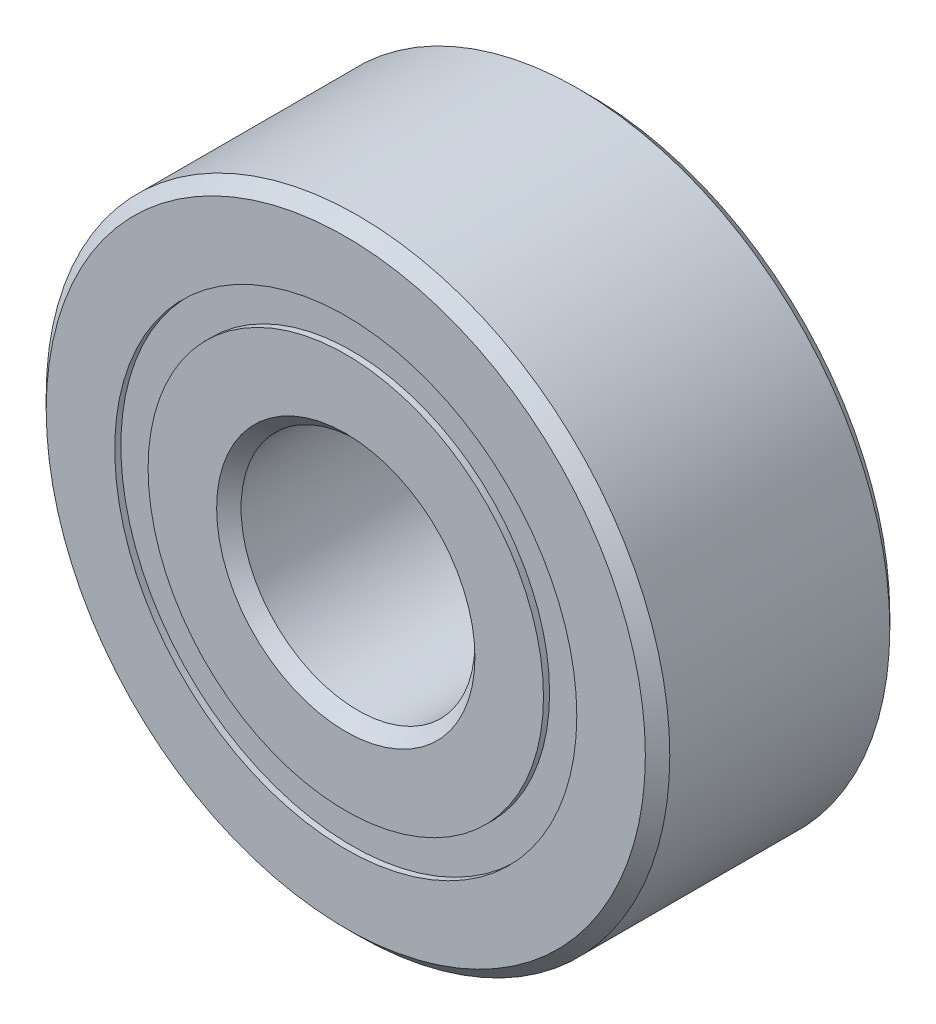
ISO-10303-21;
HEADER;
FILE_DESCRIPTION(('STEP AP214'),'2;1');
FILE_NAME('part.step','',(''),(''),'','','');
FILE_SCHEMA(('AUTOMOTIVE_DESIGN { 1 0 10303 214 1 1 1 1 }'));
ENDSEC;
DATA;
#1=APPLICATION_CONTEXT('core data for automotive mechanical design processes');
#2=APPLICATION_PROTOCOL_DEFINITION('international standard','automotive_design',2000,#1);
#3=PRODUCT_CONTEXT('',#1,'mechanical');
#4=PRODUCT('Part','Part','',(#3));
#5=PRODUCT_RELATED_PRODUCT_CATEGORY('part','',(#4));
#6=PRODUCT_DEFINITION_FORMATION('','',#4);
#7=PRODUCT_DEFINITION_CONTEXT('part definition',#1,'design');
#8=PRODUCT_DEFINITION('design','',#6,#7);
#9=PRODUCT_DEFINITION_SHAPE('','',#8);
#10=(LENGTH_UNIT() NAMED_UNIT(*) SI_UNIT(.MILLI.,.METRE.));
#11=(NAMED_UNIT(*) PLANE_ANGLE_UNIT() SI_UNIT($,.RADIAN.));
#12=(NAMED_UNIT(*) SI_UNIT($,.STERADIAN.) SOLID_ANGLE_UNIT());
#13=UNCERTAINTY_MEASURE_WITH_UNIT(LENGTH_MEASURE(1.E-05),#10,'distance_accuracy_value','');
#14=(GEOMETRIC_REPRESENTATION_CONTEXT(3) GLOBAL_UNCERTAINTY_ASSIGNED_CONTEXT((#13)) GLOBAL_UNIT_ASSIGNED_CONTEXT((#10,
#11,#12)) REPRESENTATION_CONTEXT('',''));
#15=CARTESIAN_POINT('',(0.,0.,0.));
#16=DIRECTION('',(0.,0.,1.));
#17=DIRECTION('',(1.,0.,0.));
#18=AXIS2_PLACEMENT_3D('',#15,#16,#17);
#19=CARTESIAN_POINT('',(0.,4.70503598901099,-2.36474000000001));
#20=DIRECTION('',(0.,0.,1.));
#21=DIRECTION('',(1.,0.,0.));
#22=AXIS2_PLACEMENT_3D('',#19,#20,#21);
#23=PLANE('',#22);
#24=CARTESIAN_POINT('',(0.,0.,-2.36474000000001));
#25=DIRECTION('',(0.,0.,1.));
#26=DIRECTION('',(1.,0.,0.));
#27=AXIS2_PLACEMENT_3D('',#24,#25,#26);
#28=CIRCLE('',#27,4.70503598901099);
#29=CARTESIAN_POINT('',(4.70503598901099,0.,-2.36474000000001));
#30=VERTEX_POINT('',#29);
#31=EDGE_CURVE('E60',#30,#30,#28,.T.);
#32=ORIENTED_EDGE('',*,*,#31,.F.);
#33=EDGE_LOOP('',(#32));
#34=FACE_BOUND('',#33,.T.);
#35=CARTESIAN_POINT('',(0.,0.,-2.36474000000001));
#36=DIRECTION('',(0.,0.,1.));
#37=DIRECTION('',(1.,0.,0.));
#38=AXIS2_PLACEMENT_3D('',#35,#36,#37);
#39=CIRCLE('',#38,4.02621401098901);
#40=CARTESIAN_POINT('',(4.02621401098901,0.,-2.36474000000001));
#41=VERTEX_POINT('',#40);
#42=EDGE_CURVE('E11',#41,#41,#39,.T.);
#43=ORIENTED_EDGE('',*,*,#42,.T.);
#44=EDGE_LOOP('',(#43));
#45=FACE_BOUND('',#44,.T.);
#46=ADVANCED_FACE('F46',(#34,#45),#23,.F.);
#47=CARTESIAN_POINT('',(0.,0.,2.4892));
#48=DIRECTION('',(0.,0.,1.));
#49=DIRECTION('',(1.,0.,0.));
#50=AXIS2_PLACEMENT_3D('',#47,#48,#49);
#51=CYLINDRICAL_SURFACE('',#50,4.02621401098901);
#52=ORIENTED_EDGE('',*,*,#42,.F.);
#53=EDGE_LOOP('',(#52));
#54=FACE_BOUND('',#53,.T.);
#55=CARTESIAN_POINT('',(0.,0.,-1.15720529467736));
#56=DIRECTION('',(0.,0.,1.));
#57=DIRECTION('',(1.,0.,0.));
#58=AXIS2_PLACEMENT_3D('',#55,#56,#57);
#59=CIRCLE('',#58,4.02621401098901);
#60=CARTESIAN_POINT('',(4.02621401098901,0.,-1.15720529467736));
#61=VERTEX_POINT('',#60);
#62=EDGE_CURVE('E52',#61,#61,#59,.T.);
#63=ORIENTED_EDGE('',*,*,#62,.T.);
#64=EDGE_LOOP('',(#63));
#65=FACE_BOUND('',#64,.T.);
#66=ADVANCED_FACE('F69',(#54,#65),#51,.F.);
#67=CARTESIAN_POINT('',(0.,4.70503598901099,-1.15720529467736));
#68=DIRECTION('',(0.,0.,-1.));
#69=DIRECTION('',(-1.,0.,0.));
#70=AXIS2_PLACEMENT_3D('',#67,#68,#69);
#71=PLANE('',#70);
#72=ORIENTED_EDGE('',*,*,#62,.F.);
#73=EDGE_LOOP('',(#72));
#74=FACE_BOUND('',#73,.T.);
#75=CARTESIAN_POINT('',(0.,0.,-1.15720529467736));
#76=DIRECTION('',(0.,0.,1.));
#77=DIRECTION('',(1.,0.,0.));
#78=AXIS2_PLACEMENT_3D('',#75,#76,#77);
#79=CIRCLE('',#78,4.70503598901099);
#80=CARTESIAN_POINT('',(4.70503598901099,0.,-1.15720529467736));
#81=VERTEX_POINT('',#80);
#82=EDGE_CURVE('E56',#81,#81,#79,.T.);
#83=ORIENTED_EDGE('',*,*,#82,.T.);
#84=EDGE_LOOP('',(#83));
#85=FACE_BOUND('',#84,.T.);
#86=ADVANCED_FACE('F73',(#74,#85),#71,.F.);
#87=CARTESIAN_POINT('',(0.,0.,2.4892));
#88=DIRECTION('',(0.,0.,1.));
#89=DIRECTION('',(1.,0.,0.));
#90=AXIS2_PLACEMENT_3D('',#87,#88,#89);
#91=CYLINDRICAL_SURFACE('',#90,4.70503598901099);
#92=ORIENTED_EDGE('',*,*,#82,.F.);
#93=EDGE_LOOP('',(#92));
#94=FACE_BOUND('',#93,.T.);
#95=ORIENTED_EDGE('',*,*,#31,.T.);
#96=EDGE_LOOP('',(#95));
#97=FACE_BOUND('',#96,.T.);
#98=ADVANCED_FACE('F66',(#94,#97),#91,.T.);
#99=CLOSED_SHELL('',(#46,#66,#86,#98));
#100=MANIFOLD_SOLID_BREP('B2',#99);
#101=CARTESIAN_POINT('',(0.,4.70503598901099,2.36474));
#102=DIRECTION('',(0.,0.,-1.));
#103=DIRECTION('',(-1.,0.,0.));
#104=AXIS2_PLACEMENT_3D('',#101,#102,#103);
#105=PLANE('',#104);
#106=CARTESIAN_POINT('',(0.,0.,2.36474));
#107=DIRECTION('',(0.,0.,1.));
#108=DIRECTION('',(1.,0.,0.));
#109=AXIS2_PLACEMENT_3D('',#106,#107,#108);
#110=CIRCLE('',#109,4.02621401098901);
#111=CARTESIAN_POINT('',(4.02621401098901,0.,2.36474));
#112=VERTEX_POINT('',#111);
#113=EDGE_CURVE('E45',#112,#112,#110,.T.);
#114=ORIENTED_EDGE('',*,*,#113,.F.);
#115=EDGE_LOOP('',(#114));
#116=FACE_BOUND('',#115,.T.);
#117=CARTESIAN_POINT('',(0.,0.,2.36474));
#118=DIRECTION('',(0.,0.,1.));
#119=DIRECTION('',(1.,0.,0.));
#120=AXIS2_PLACEMENT_3D('',#117,#118,#119);
#121=CIRCLE('',#120,4.70503598901099);
#122=CARTESIAN_POINT('',(4.70503598901099,0.,2.36474));
#123=VERTEX_POINT('',#122);
#124=EDGE_CURVE('E128',#123,#123,#121,.T.);
#125=ORIENTED_EDGE('',*,*,#124,.T.);
#126=EDGE_LOOP('',(#125));
#127=FACE_BOUND('',#126,.T.);
#128=ADVANCED_FACE('F114',(#116,#127),#105,.F.);
#129=CARTESIAN_POINT('',(0.,0.,2.4892));
#130=DIRECTION('',(0.,0.,1.));
#131=DIRECTION('',(1.,0.,0.));
#132=AXIS2_PLACEMENT_3D('',#129,#130,#131);
#133=CYLINDRICAL_SURFACE('',#132,4.02621401098901);
#134=CARTESIAN_POINT('',(0.,0.,1.15720529467736));
#135=DIRECTION('',(0.,0.,1.));
#136=DIRECTION('',(1.,0.,0.));
#137=AXIS2_PLACEMENT_3D('',#134,#135,#136);
#138=CIRCLE('',#137,4.02621401098901);
#139=CARTESIAN_POINT('',(4.02621401098901,0.,1.15720529467736));
#140=VERTEX_POINT('',#139);
#141=EDGE_CURVE('E120',#140,#140,#138,.T.);
#142=ORIENTED_EDGE('',*,*,#141,.F.);
#143=EDGE_LOOP('',(#142));
#144=FACE_BOUND('',#143,.T.);
#145=ORIENTED_EDGE('',*,*,#113,.T.);
#146=EDGE_LOOP('',(#145));
#147=FACE_BOUND('',#146,.T.);
#148=ADVANCED_FACE('F143',(#144,#147),#133,.F.);
#149=CARTESIAN_POINT('',(0.,4.70503598901099,1.15720529467736));
#150=DIRECTION('',(0.,0.,1.));
#151=DIRECTION('',(1.,0.,0.));
#152=AXIS2_PLACEMENT_3D('',#149,#150,#151);
#153=PLANE('',#152);
#154=CARTESIAN_POINT('',(0.,0.,1.15720529467736));
#155=DIRECTION('',(0.,0.,1.));
#156=DIRECTION('',(1.,0.,0.));
#157=AXIS2_PLACEMENT_3D('',#154,#155,#156);
#158=CIRCLE('',#157,4.70503598901099);
#159=CARTESIAN_POINT('',(4.70503598901099,0.,1.15720529467736));
#160=VERTEX_POINT('',#159);
#161=EDGE_CURVE('E124',#160,#160,#158,.T.);
#162=ORIENTED_EDGE('',*,*,#161,.F.);
#163=EDGE_LOOP('',(#162));
#164=FACE_BOUND('',#163,.T.);
#165=ORIENTED_EDGE('',*,*,#141,.T.);
#166=EDGE_LOOP('',(#165));
#167=FACE_BOUND('',#166,.T.);
#168=ADVANCED_FACE('F138',(#164,#167),#153,.F.);
#169=CARTESIAN_POINT('',(0.,0.,2.4892));
#170=DIRECTION('',(0.,0.,1.));
#171=DIRECTION('',(1.,0.,0.));
#172=AXIS2_PLACEMENT_3D('',#169,#170,#171);
#173=CYLINDRICAL_SURFACE('',#172,4.70503598901099);
#174=ORIENTED_EDGE('',*,*,#124,.F.);
#175=EDGE_LOOP('',(#174));
#176=FACE_BOUND('',#175,.T.);
#177=ORIENTED_EDGE('',*,*,#161,.T.);
#178=EDGE_LOOP('',(#177));
#179=FACE_BOUND('',#178,.T.);
#180=ADVANCED_FACE('F135',(#176,#179),#173,.T.);
#181=CLOSED_SHELL('',(#128,#148,#168,#180));
#182=MANIFOLD_SOLID_BREP('B6',#181);
#183=CARTESIAN_POINT('',(-3.08696304161748,3.08696304161756,0.));
#184=DIRECTION('',(0.,0.,1.));
#185=DIRECTION('',(-0.707106781186539,0.707106781186556,0.));
#186=AXIS2_PLACEMENT_3D('',#183,#184,#185);
#187=SPHERICAL_SURFACE('',#186,1.15720529467736);
#188=CARTESIAN_POINT('',(-3.08696304161748,3.08696304161756,1.15720529467736));
#189=VERTEX_POINT('',#188);
#190=VERTEX_LOOP('',#189);
#191=FACE_BOUND('',#190,.T.);
#192=ADVANCED_FACE('F182',(#191),#187,.T.);
#193=CLOSED_SHELL('',(#192));
#194=MANIFOLD_SOLID_BREP('B40',#193);
#195=CARTESIAN_POINT('',(-4.365625,0.,0.));
#196=DIRECTION('',(0.,0.,1.));
#197=DIRECTION('',(-1.,0.,0.));
#198=AXIS2_PLACEMENT_3D('',#195,#196,#197);
#199=SPHERICAL_SURFACE('',#198,1.15720529467736);
#200=CARTESIAN_POINT('',(-4.365625,0.,1.15720529467736));
#201=VERTEX_POINT('',#200);
#202=VERTEX_LOOP('',#201);
#203=FACE_BOUND('',#202,.T.);
#204=ADVANCED_FACE('F203',(#203),#199,.T.);
#205=CLOSED_SHELL('',(#204));
#206=MANIFOLD_SOLID_BREP('B110',#205);
#207=CARTESIAN_POINT('',(-3.08696304161755,-3.0869630416175,0.));
#208=DIRECTION('',(0.,0.,1.));
#209=DIRECTION('',(-0.707106781186554,-0.707106781186541,0.));
#210=AXIS2_PLACEMENT_3D('',#207,#208,#209);
#211=SPHERICAL_SURFACE('',#210,1.15720529467736);
#212=CARTESIAN_POINT('',(-3.08696304161755,-3.0869630416175,1.15720529467736));
#213=VERTEX_POINT('',#212);
#214=VERTEX_LOOP('',#213);
#215=FACE_BOUND('',#214,.T.);
#216=ADVANCED_FACE('F224',(#215),#211,.T.);
#217=CLOSED_SHELL('',(#216));
#218=MANIFOLD_SOLID_BREP('B178',#217);
#219=CARTESIAN_POINT('',(0.,-4.365625,0.));
#220=DIRECTION('',(0.,0.,1.));
#221=DIRECTION('',(0.,-1.,0.));
#222=AXIS2_PLACEMENT_3D('',#219,#220,#221);
#223=SPHERICAL_SURFACE('',#222,1.15720529467736);
#224=CARTESIAN_POINT('',(0.,-4.365625,1.15720529467736));
#225=VERTEX_POINT('',#224);
#226=VERTEX_LOOP('',#225);
#227=FACE_BOUND('',#226,.T.);
#228=ADVANCED_FACE('F245',(#227),#223,.T.);
#229=CLOSED_SHELL('',(#228));
#230=MANIFOLD_SOLID_BREP('B199',#229);
#231=CARTESIAN_POINT('',(3.08696304161751,-3.08696304161754,0.));
#232=DIRECTION('',(0.,0.,1.));
#233=DIRECTION('',(0.707106781186544,-0.707106781186551,0.));
#234=AXIS2_PLACEMENT_3D('',#231,#232,#233);
#235=SPHERICAL_SURFACE('',#234,1.15720529467736);
#236=CARTESIAN_POINT('',(3.08696304161751,-3.08696304161754,1.15720529467736));
#237=VERTEX_POINT('',#236);
#238=VERTEX_LOOP('',#237);
#239=FACE_BOUND('',#238,.T.);
#240=ADVANCED_FACE('F266',(#239),#235,.T.);
#241=CLOSED_SHELL('',(#240));
#242=MANIFOLD_SOLID_BREP('B220',#241);
#243=CARTESIAN_POINT('',(4.365625,0.,0.));
#244=DIRECTION('',(0.,0.,1.));
#245=DIRECTION('',(1.,0.,0.));
#246=AXIS2_PLACEMENT_3D('',#243,#244,#245);
#247=SPHERICAL_SURFACE('',#246,1.15720529467736);
#248=CARTESIAN_POINT('',(4.365625,0.,1.15720529467736));
#249=VERTEX_POINT('',#248);
#250=VERTEX_LOOP('',#249);
#251=FACE_BOUND('',#250,.T.);
#252=ADVANCED_FACE('F287',(#251),#247,.T.);
#253=CLOSED_SHELL('',(#252));
#254=MANIFOLD_SOLID_BREP('B241',#253);
#255=CARTESIAN_POINT('',(3.08696304161753,3.08696304161752,0.));
#256=DIRECTION('',(0.,0.,1.));
#257=DIRECTION('',(0.707106781186549,0.707106781186546,0.));
#258=AXIS2_PLACEMENT_3D('',#255,#256,#257);
#259=SPHERICAL_SURFACE('',#258,1.15720529467736);
#260=CARTESIAN_POINT('',(3.08696304161753,3.08696304161752,1.15720529467736));
#261=VERTEX_POINT('',#260);
#262=VERTEX_LOOP('',#261);
#263=FACE_BOUND('',#262,.T.);
#264=ADVANCED_FACE('F308',(#263),#259,.T.);
#265=CLOSED_SHELL('',(#264));
#266=MANIFOLD_SOLID_BREP('B262',#265);
#267=CARTESIAN_POINT('',(0.,4.365625,0.));
#268=DIRECTION('',(0.,0.,1.));
#269=DIRECTION('',(0.,1.,0.));
#270=AXIS2_PLACEMENT_3D('',#267,#268,#269);
#271=SPHERICAL_SURFACE('',#270,1.15720529467736);
#272=CARTESIAN_POINT('',(0.,4.365625,1.15720529467736));
#273=VERTEX_POINT('',#272);
#274=VERTEX_LOOP('',#273);
#275=FACE_BOUND('',#274,.T.);
#276=ADVANCED_FACE('F331',(#275),#271,.T.);
#277=CLOSED_SHELL('',(#276));
#278=MANIFOLD_SOLID_BREP('B283',#277);
#279=CARTESIAN_POINT('',(0.,4.02621401098901,2.4892));
#280=DIRECTION('',(0.,0.,-1.));
#281=DIRECTION('',(-1.,0.,0.));
#282=AXIS2_PLACEMENT_3D('',#279,#280,#281);
#283=PLANE('',#282);
#284=CARTESIAN_POINT('',(0.,0.,2.4892));
#285=DIRECTION('',(0.,0.,1.));
#286=DIRECTION('',(1.,0.,0.));
#287=AXIS2_PLACEMENT_3D('',#284,#285,#286);
#288=CIRCLE('',#287,2.63017);
#289=CARTESIAN_POINT('',(2.63017,0.,2.4892));
#290=VERTEX_POINT('',#289);
#291=EDGE_CURVE('E379',#290,#290,#288,.T.);
#292=ORIENTED_EDGE('',*,*,#291,.F.);
#293=EDGE_LOOP('',(#292));
#294=FACE_BOUND('',#293,.T.);
#295=CARTESIAN_POINT('',(0.,0.,2.4892));
#296=DIRECTION('',(0.,0.,1.));
#297=DIRECTION('',(1.,0.,0.));
#298=AXIS2_PLACEMENT_3D('',#295,#296,#297);
#299=CIRCLE('',#298,4.02621401098901);
#300=CARTESIAN_POINT('',(4.02621401098901,0.,2.4892));
#301=VERTEX_POINT('',#300);
#302=EDGE_CURVE('E330',#301,#301,#299,.T.);
#303=ORIENTED_EDGE('',*,*,#302,.T.);
#304=EDGE_LOOP('',(#303));
#305=FACE_BOUND('',#304,.T.);
#306=ADVANCED_FACE('F351',(#294,#305),#283,.F.);
#307=CARTESIAN_POINT('',(0.,0.,2.4892));
#308=DIRECTION('',(0.,0.,1.));
#309=DIRECTION('',(1.,0.,0.));
#310=AXIS2_PLACEMENT_3D('',#307,#308,#309);
#311=CYLINDRICAL_SURFACE('',#310,4.02621401098901);
#312=ORIENTED_EDGE('',*,*,#302,.F.);
#313=EDGE_LOOP('',(#312));
#314=FACE_BOUND('',#313,.T.);
#315=CARTESIAN_POINT('',(0.,0.,1.10631111111111));
#316=DIRECTION('',(0.,0.,1.));
#317=DIRECTION('',(1.,0.,0.));
#318=AXIS2_PLACEMENT_3D('',#315,#316,#317);
#319=CIRCLE('',#318,4.02621401098901);
#320=CARTESIAN_POINT('',(4.02621401098901,0.,1.10631111111111));
#321=VERTEX_POINT('',#320);
#322=EDGE_CURVE('E357',#321,#321,#319,.T.);
#323=ORIENTED_EDGE('',*,*,#322,.T.);
#324=EDGE_LOOP('',(#323));
#325=FACE_BOUND('',#324,.T.);
#326=ADVANCED_FACE('F386',(#314,#325),#311,.T.);
#327=CARTESIAN_POINT('',(0.,0.,0.));
#328=DIRECTION('',(0.,0.,1.));
#329=DIRECTION('',(1.,0.,0.));
#330=AXIS2_PLACEMENT_3D('',#327,#328,#329);
#331=TOROIDAL_SURFACE('',#330,4.36562499999999,1.15720529467736);
#332=ORIENTED_EDGE('',*,*,#322,.F.);
#333=EDGE_LOOP('',(#332));
#334=FACE_BOUND('',#333,.T.);
#335=CARTESIAN_POINT('',(0.,0.,-1.10631111111111));
#336=DIRECTION('',(0.,0.,1.));
#337=DIRECTION('',(1.,0.,0.));
#338=AXIS2_PLACEMENT_3D('',#335,#336,#337);
#339=CIRCLE('',#338,4.02621401098901);
#340=CARTESIAN_POINT('',(4.02621401098901,0.,-1.10631111111111));
#341=VERTEX_POINT('',#340);
#342=EDGE_CURVE('E361',#341,#341,#339,.T.);
#343=ORIENTED_EDGE('',*,*,#342,.T.);
#344=EDGE_LOOP('',(#343));
#345=FACE_BOUND('',#344,.T.);
#346=ADVANCED_FACE('F390',(#334,#345),#331,.F.);
#347=CARTESIAN_POINT('',(0.,0.,2.4892));
#348=DIRECTION('',(0.,0.,1.));
#349=DIRECTION('',(1.,0.,0.));
#350=AXIS2_PLACEMENT_3D('',#347,#348,#349);
#351=CYLINDRICAL_SURFACE('',#350,4.02621401098901);
#352=ORIENTED_EDGE('',*,*,#342,.F.);
#353=EDGE_LOOP('',(#352));
#354=FACE_BOUND('',#353,.T.);
#355=CARTESIAN_POINT('',(0.,0.,-2.4892));
#356=DIRECTION('',(0.,0.,1.));
#357=DIRECTION('',(1.,0.,0.));
#358=AXIS2_PLACEMENT_3D('',#355,#356,#357);
#359=CIRCLE('',#358,4.02621401098901);
#360=CARTESIAN_POINT('',(4.02621401098901,0.,-2.4892));
#361=VERTEX_POINT('',#360);
#362=EDGE_CURVE('E365',#361,#361,#359,.T.);
#363=ORIENTED_EDGE('',*,*,#362,.T.);
#364=EDGE_LOOP('',(#363));
#365=FACE_BOUND('',#364,.T.);
#366=ADVANCED_FACE('F395',(#354,#365),#351,.T.);
#367=CARTESIAN_POINT('',(0.,2.63017,-2.48920000000001));
#368=DIRECTION('',(0.,0.,1.));
#369=DIRECTION('',(1.,0.,0.));
#370=AXIS2_PLACEMENT_3D('',#367,#368,#369);
#371=PLANE('',#370);
#372=ORIENTED_EDGE('',*,*,#362,.F.);
#373=EDGE_LOOP('',(#372));
#374=FACE_BOUND('',#373,.T.);
#375=CARTESIAN_POINT('',(0.,0.,-2.48920000000001));
#376=DIRECTION('',(0.,0.,1.));
#377=DIRECTION('',(1.,0.,0.));
#378=AXIS2_PLACEMENT_3D('',#375,#376,#377);
#379=CIRCLE('',#378,2.63017);
#380=CARTESIAN_POINT('',(2.63017,0.,-2.48920000000001));
#381=VERTEX_POINT('',#380);
#382=EDGE_CURVE('E370',#381,#381,#379,.T.);
#383=ORIENTED_EDGE('',*,*,#382,.T.);
#384=EDGE_LOOP('',(#383));
#385=FACE_BOUND('',#384,.T.);
#386=ADVANCED_FACE('F401',(#374,#385),#371,.F.);
#387=CARTESIAN_POINT('',(0.,0.,-2.24028000000001));
#388=DIRECTION('',(0.,0.,-1.));
#389=DIRECTION('',(-1.,0.,0.));
#390=AXIS2_PLACEMENT_3D('',#387,#388,#389);
#391=CONICAL_SURFACE('',#390,2.38125,0.785398163397448);
#392=ORIENTED_EDGE('',*,*,#382,.F.);
#393=EDGE_LOOP('',(#392));
#394=FACE_BOUND('',#393,.T.);
#395=CARTESIAN_POINT('',(0.,0.,-2.24028000000001));
#396=DIRECTION('',(0.,0.,1.));
#397=DIRECTION('',(1.,0.,0.));
#398=AXIS2_PLACEMENT_3D('',#395,#396,#397);
#399=CIRCLE('',#398,2.38125);
#400=CARTESIAN_POINT('',(2.38125,0.,-2.24028000000001));
#401=VERTEX_POINT('',#400);
#402=EDGE_CURVE('E373',#401,#401,#399,.T.);
#403=ORIENTED_EDGE('',*,*,#402,.T.);
#404=EDGE_LOOP('',(#403));
#405=FACE_BOUND('',#404,.T.);
#406=ADVANCED_FACE('F405',(#394,#405),#391,.F.);
#407=CARTESIAN_POINT('',(0.,0.,2.4892));
#408=DIRECTION('',(0.,0.,1.));
#409=DIRECTION('',(1.,0.,0.));
#410=AXIS2_PLACEMENT_3D('',#407,#408,#409);
#411=CYLINDRICAL_SURFACE('',#410,2.38125);
#412=ORIENTED_EDGE('',*,*,#402,.F.);
#413=EDGE_LOOP('',(#412));
#414=FACE_BOUND('',#413,.T.);
#415=CARTESIAN_POINT('',(0.,0.,2.24028));
#416=DIRECTION('',(0.,0.,1.));
#417=DIRECTION('',(1.,0.,0.));
#418=AXIS2_PLACEMENT_3D('',#415,#416,#417);
#419=CIRCLE('',#418,2.38125);
#420=CARTESIAN_POINT('',(2.38125,0.,2.24028));
#421=VERTEX_POINT('',#420);
#422=EDGE_CURVE('E376',#421,#421,#419,.T.);
#423=ORIENTED_EDGE('',*,*,#422,.T.);
#424=EDGE_LOOP('',(#423));
#425=FACE_BOUND('',#424,.T.);
#426=ADVANCED_FACE('F409',(#414,#425),#411,.F.);
#427=CARTESIAN_POINT('',(0.,0.,2.4892));
#428=DIRECTION('',(0.,0.,1.));
#429=DIRECTION('',(1.,0.,0.));
#430=AXIS2_PLACEMENT_3D('',#427,#428,#429);
#431=CONICAL_SURFACE('',#430,2.63017,0.785398163397447);
#432=ORIENTED_EDGE('',*,*,#422,.F.);
#433=EDGE_LOOP('',(#432));
#434=FACE_BOUND('',#433,.T.);
#435=ORIENTED_EDGE('',*,*,#291,.T.);
#436=EDGE_LOOP('',(#435));
#437=FACE_BOUND('',#436,.T.);
#438=ADVANCED_FACE('F383',(#434,#437),#431,.F.);
#439=CLOSED_SHELL('',(#306,#326,#346,#366,#386,#406,#426,#438));
#440=MANIFOLD_SOLID_BREP('B304',#439);
#441=CARTESIAN_POINT('',(0.,0.,2.24028));
#442=DIRECTION('',(0.,0.,-1.));
#443=DIRECTION('',(-1.,0.,0.));
#444=AXIS2_PLACEMENT_3D('',#441,#442,#443);
#445=CONICAL_SURFACE('',#444,6.35,0.785398163397447);
#446=CARTESIAN_POINT('',(0.,0.,2.4892));
#447=DIRECTION('',(0.,0.,1.));
#448=DIRECTION('',(1.,0.,0.));
#449=AXIS2_PLACEMENT_3D('',#446,#447,#448);
#450=CIRCLE('',#449,6.10108);
#451=CARTESIAN_POINT('',(6.10108,0.,2.4892));
#452=VERTEX_POINT('',#451);
#453=EDGE_CURVE('E501',#452,#452,#450,.T.);
#454=ORIENTED_EDGE('',*,*,#453,.F.);
#455=EDGE_LOOP('',(#454));
#456=FACE_BOUND('',#455,.T.);
#457=CARTESIAN_POINT('',(0.,0.,2.24028));
#458=DIRECTION('',(0.,0.,1.));
#459=DIRECTION('',(1.,0.,0.));
#460=AXIS2_PLACEMENT_3D('',#457,#458,#459);
#461=CIRCLE('',#460,6.35);
#462=CARTESIAN_POINT('',(6.35,0.,2.24028));
#463=VERTEX_POINT('',#462);
#464=EDGE_CURVE('E350',#463,#463,#461,.T.);
#465=ORIENTED_EDGE('',*,*,#464,.T.);
#466=EDGE_LOOP('',(#465));
#467=FACE_BOUND('',#466,.T.);
#468=ADVANCED_FACE('F473',(#456,#467),#445,.T.);
#469=CARTESIAN_POINT('',(0.,0.,2.4892));
#470=DIRECTION('',(0.,0.,1.));
#471=DIRECTION('',(1.,0.,0.));
#472=AXIS2_PLACEMENT_3D('',#469,#470,#471);
#473=CYLINDRICAL_SURFACE('',#472,6.35);
#474=ORIENTED_EDGE('',*,*,#464,.F.);
#475=EDGE_LOOP('',(#474));
#476=FACE_BOUND('',#475,.T.);
#477=CARTESIAN_POINT('',(0.,0.,-2.24028000000001));
#478=DIRECTION('',(0.,0.,1.));
#479=DIRECTION('',(1.,0.,0.));
#480=AXIS2_PLACEMENT_3D('',#477,#478,#479);
#481=CIRCLE('',#480,6.35);
#482=CARTESIAN_POINT('',(6.35,0.,-2.24028000000001));
#483=VERTEX_POINT('',#482);
#484=EDGE_CURVE('E479',#483,#483,#481,.T.);
#485=ORIENTED_EDGE('',*,*,#484,.T.);
#486=EDGE_LOOP('',(#485));
#487=FACE_BOUND('',#486,.T.);
#488=ADVANCED_FACE('F508',(#476,#487),#473,.T.);
#489=CARTESIAN_POINT('',(0.,0.,-2.48920000000001));
#490=DIRECTION('',(0.,0.,1.));
#491=DIRECTION('',(1.,0.,0.));
#492=AXIS2_PLACEMENT_3D('',#489,#490,#491);
#493=CONICAL_SURFACE('',#492,6.10108,0.785398163397448);
#494=ORIENTED_EDGE('',*,*,#484,.F.);
#495=EDGE_LOOP('',(#494));
#496=FACE_BOUND('',#495,.T.);
#497=CARTESIAN_POINT('',(0.,0.,-2.48920000000001));
#498=DIRECTION('',(0.,0.,1.));
#499=DIRECTION('',(1.,0.,0.));
#500=AXIS2_PLACEMENT_3D('',#497,#498,#499);
#501=CIRCLE('',#500,6.10108);
#502=CARTESIAN_POINT('',(6.10108,0.,-2.48920000000001));
#503=VERTEX_POINT('',#502);
#504=EDGE_CURVE('E483',#503,#503,#501,.T.);
#505=ORIENTED_EDGE('',*,*,#504,.T.);
#506=EDGE_LOOP('',(#505));
#507=FACE_BOUND('',#506,.T.);
#508=ADVANCED_FACE('F512',(#496,#507),#493,.T.);
#509=CARTESIAN_POINT('',(0.,6.10108,-2.48920000000001));
#510=DIRECTION('',(0.,0.,1.));
#511=DIRECTION('',(1.,0.,0.));
#512=AXIS2_PLACEMENT_3D('',#509,#510,#511);
#513=PLANE('',#512);
#514=ORIENTED_EDGE('',*,*,#504,.F.);
#515=EDGE_LOOP('',(#514));
#516=FACE_BOUND('',#515,.T.);
#517=CARTESIAN_POINT('',(0.,0.,-2.48920000000001));
#518=DIRECTION('',(0.,0.,1.));
#519=DIRECTION('',(1.,0.,0.));
#520=AXIS2_PLACEMENT_3D('',#517,#518,#519);
#521=CIRCLE('',#520,4.70503598901099);
#522=CARTESIAN_POINT('',(4.70503598901099,0.,-2.48920000000001));
#523=VERTEX_POINT('',#522);
#524=EDGE_CURVE('E487',#523,#523,#521,.T.);
#525=ORIENTED_EDGE('',*,*,#524,.T.);
#526=EDGE_LOOP('',(#525));
#527=FACE_BOUND('',#526,.T.);
#528=ADVANCED_FACE('F517',(#516,#527),#513,.F.);
#529=CARTESIAN_POINT('',(0.,0.,2.4892));
#530=DIRECTION('',(0.,0.,1.));
#531=DIRECTION('',(1.,0.,0.));
#532=AXIS2_PLACEMENT_3D('',#529,#530,#531);
#533=CYLINDRICAL_SURFACE('',#532,4.70503598901099);
#534=ORIENTED_EDGE('',*,*,#524,.F.);
#535=EDGE_LOOP('',(#534));
#536=FACE_BOUND('',#535,.T.);
#537=CARTESIAN_POINT('',(0.,0.,-1.10631111111111));
#538=DIRECTION('',(0.,0.,1.));
#539=DIRECTION('',(1.,0.,0.));
#540=AXIS2_PLACEMENT_3D('',#537,#538,#539);
#541=CIRCLE('',#540,4.70503598901099);
#542=CARTESIAN_POINT('',(4.70503598901099,0.,-1.10631111111111));
#543=VERTEX_POINT('',#542);
#544=EDGE_CURVE('E492',#543,#543,#541,.T.);
#545=ORIENTED_EDGE('',*,*,#544,.T.);
#546=EDGE_LOOP('',(#545));
#547=FACE_BOUND('',#546,.T.);
#548=ADVANCED_FACE('F523',(#536,#547),#533,.F.);
#549=CARTESIAN_POINT('',(0.,0.,0.));
#550=DIRECTION('',(0.,0.,1.));
#551=DIRECTION('',(1.,0.,0.));
#552=AXIS2_PLACEMENT_3D('',#549,#550,#551);
#553=TOROIDAL_SURFACE('',#552,4.365625,1.15720529467736);
#554=ORIENTED_EDGE('',*,*,#544,.F.);
#555=EDGE_LOOP('',(#554));
#556=FACE_BOUND('',#555,.T.);
#557=CARTESIAN_POINT('',(0.,0.,1.10631111111111));
#558=DIRECTION('',(0.,0.,1.));
#559=DIRECTION('',(1.,0.,0.));
#560=AXIS2_PLACEMENT_3D('',#557,#558,#559);
#561=CIRCLE('',#560,4.70503598901099);
#562=CARTESIAN_POINT('',(4.70503598901099,0.,1.10631111111111));
#563=VERTEX_POINT('',#562);
#564=EDGE_CURVE('E495',#563,#563,#561,.T.);
#565=ORIENTED_EDGE('',*,*,#564,.T.);
#566=EDGE_LOOP('',(#565));
#567=FACE_BOUND('',#566,.T.);
#568=ADVANCED_FACE('F527',(#556,#567),#553,.F.);
#569=CARTESIAN_POINT('',(0.,0.,2.4892));
#570=DIRECTION('',(0.,0.,1.));
#571=DIRECTION('',(1.,0.,0.));
#572=AXIS2_PLACEMENT_3D('',#569,#570,#571);
#573=CYLINDRICAL_SURFACE('',#572,4.70503598901099);
#574=ORIENTED_EDGE('',*,*,#564,.F.);
#575=EDGE_LOOP('',(#574));
#576=FACE_BOUND('',#575,.T.);
#577=CARTESIAN_POINT('',(0.,0.,2.4892));
#578=DIRECTION('',(0.,0.,1.));
#579=DIRECTION('',(1.,0.,0.));
#580=AXIS2_PLACEMENT_3D('',#577,#578,#579);
#581=CIRCLE('',#580,4.70503598901099);
#582=CARTESIAN_POINT('',(4.70503598901099,0.,2.4892));
#583=VERTEX_POINT('',#582);
#584=EDGE_CURVE('E498',#583,#583,#581,.T.);
#585=ORIENTED_EDGE('',*,*,#584,.T.);
#586=EDGE_LOOP('',(#585));
#587=FACE_BOUND('',#586,.T.);
#588=ADVANCED_FACE('F531',(#576,#587),#573,.F.);
#589=CARTESIAN_POINT('',(0.,6.10108,2.4892));
#590=DIRECTION('',(0.,0.,-1.));
#591=DIRECTION('',(-1.,0.,0.));
#592=AXIS2_PLACEMENT_3D('',#589,#590,#591);
#593=PLANE('',#592);
#594=ORIENTED_EDGE('',*,*,#584,.F.);
#595=EDGE_LOOP('',(#594));
#596=FACE_BOUND('',#595,.T.);
#597=ORIENTED_EDGE('',*,*,#453,.T.);
#598=EDGE_LOOP('',(#597));
#599=FACE_BOUND('',#598,.T.);
#600=ADVANCED_FACE('F505',(#596,#599),#593,.F.);
#601=CLOSED_SHELL('',(#468,#488,#508,#528,#548,#568,#588,#600));
#602=MANIFOLD_SOLID_BREP('B325',#601);
#603=ADVANCED_BREP_SHAPE_REPRESENTATION('',(#18,#100,#182,#194,#206,#218,#230,#242,#254,#266,
#278,#440,#602),#14);
#604=SHAPE_DEFINITION_REPRESENTATION(#9,#603);
ENDSEC;
END-ISO-10303-21;
